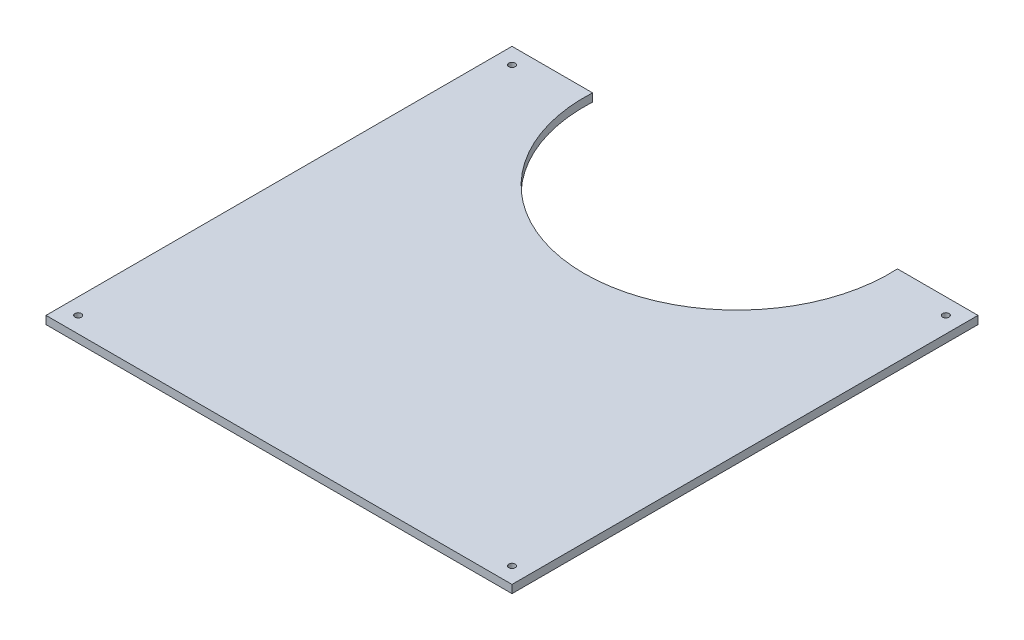
ISO-10303-21;
HEADER;
FILE_DESCRIPTION(('STEP AP214'),'2;1');
FILE_NAME('part.step','',(''),(''),'','','');
FILE_SCHEMA(('AUTOMOTIVE_DESIGN { 1 0 10303 214 1 1 1 1 }'));
ENDSEC;
DATA;
#1=APPLICATION_CONTEXT('core data for automotive mechanical design processes');
#2=APPLICATION_PROTOCOL_DEFINITION('international standard','automotive_design',2000,#1);
#3=PRODUCT_CONTEXT('',#1,'mechanical');
#4=PRODUCT('Part','Part','',(#3));
#5=PRODUCT_RELATED_PRODUCT_CATEGORY('part','',(#4));
#6=PRODUCT_DEFINITION_FORMATION('','',#4);
#7=PRODUCT_DEFINITION_CONTEXT('part definition',#1,'design');
#8=PRODUCT_DEFINITION('design','',#6,#7);
#9=PRODUCT_DEFINITION_SHAPE('','',#8);
#10=(LENGTH_UNIT() NAMED_UNIT(*) SI_UNIT(.MILLI.,.METRE.));
#11=(NAMED_UNIT(*) PLANE_ANGLE_UNIT() SI_UNIT($,.RADIAN.));
#12=(NAMED_UNIT(*) SI_UNIT($,.STERADIAN.) SOLID_ANGLE_UNIT());
#13=UNCERTAINTY_MEASURE_WITH_UNIT(LENGTH_MEASURE(1.E-05),#10,'distance_accuracy_value','');
#14=(GEOMETRIC_REPRESENTATION_CONTEXT(3) GLOBAL_UNCERTAINTY_ASSIGNED_CONTEXT((#13)) GLOBAL_UNIT_ASSIGNED_CONTEXT((#10,
#11,#12)) REPRESENTATION_CONTEXT('',''));
#15=CARTESIAN_POINT('',(0.,0.,0.));
#16=DIRECTION('',(0.,0.,1.));
#17=DIRECTION('',(1.,0.,0.));
#18=AXIS2_PLACEMENT_3D('',#15,#16,#17);
#19=CARTESIAN_POINT('',(0.,5.,0.));
#20=DIRECTION('',(1.,0.,0.));
#21=DIRECTION('',(0.,0.,-1.));
#22=AXIS2_PLACEMENT_3D('',#19,#20,#21);
#23=PLANE('',#22);
#24=DIRECTION('',(0.,0.,1.));
#25=VECTOR('',#24,1.);
#26=CARTESIAN_POINT('',(0.,0.,0.));
#27=LINE('',#26,#25);
#28=CARTESIAN_POINT('',(0.,0.,-290.));
#29=VERTEX_POINT('',#28);
#30=CARTESIAN_POINT('',(0.,0.,0.));
#31=VERTEX_POINT('',#30);
#32=EDGE_CURVE('E119',#29,#31,#27,.T.);
#33=ORIENTED_EDGE('',*,*,#32,.T.);
#34=DIRECTION('',(0.,-1.,0.));
#35=VECTOR('',#34,1.);
#36=CARTESIAN_POINT('',(0.,5.,0.));
#37=LINE('',#36,#35);
#38=CARTESIAN_POINT('',(0.,5.,0.));
#39=VERTEX_POINT('',#38);
#40=EDGE_CURVE('E11',#39,#31,#37,.T.);
#41=ORIENTED_EDGE('',*,*,#40,.F.);
#42=DIRECTION('',(0.,0.,1.));
#43=VECTOR('',#42,1.);
#44=CARTESIAN_POINT('',(0.,5.,0.));
#45=LINE('',#44,#43);
#46=CARTESIAN_POINT('',(0.,5.,-290.));
#47=VERTEX_POINT('',#46);
#48=EDGE_CURVE('E130',#47,#39,#45,.T.);
#49=ORIENTED_EDGE('',*,*,#48,.F.);
#50=DIRECTION('',(0.,-1.,0.));
#51=VECTOR('',#50,1.);
#52=CARTESIAN_POINT('',(0.,5.,-290.));
#53=LINE('',#52,#51);
#54=EDGE_CURVE('E115',#47,#29,#53,.T.);
#55=ORIENTED_EDGE('',*,*,#54,.T.);
#56=EDGE_LOOP('',(#33,#41,#49,#55));
#57=FACE_BOUND('',#56,.T.);
#58=ADVANCED_FACE('F33',(#57),#23,.F.);
#59=CARTESIAN_POINT('',(0.,5.,0.));
#60=DIRECTION('',(0.,0.,-1.));
#61=DIRECTION('',(-1.,0.,0.));
#62=AXIS2_PLACEMENT_3D('',#59,#60,#61);
#63=PLANE('',#62);
#64=DIRECTION('',(1.,0.,0.));
#65=VECTOR('',#64,1.);
#66=CARTESIAN_POINT('',(0.,0.,0.));
#67=LINE('',#66,#65);
#68=CARTESIAN_POINT('',(290.,0.,0.));
#69=VERTEX_POINT('',#68);
#70=EDGE_CURVE('E122',#31,#69,#67,.T.);
#71=ORIENTED_EDGE('',*,*,#70,.T.);
#72=DIRECTION('',(0.,-1.,0.));
#73=VECTOR('',#72,1.);
#74=CARTESIAN_POINT('',(290.,5.,0.));
#75=LINE('',#74,#73);
#76=CARTESIAN_POINT('',(290.,5.,0.));
#77=VERTEX_POINT('',#76);
#78=EDGE_CURVE('E42',#77,#69,#75,.T.);
#79=ORIENTED_EDGE('',*,*,#78,.F.);
#80=DIRECTION('',(1.,0.,0.));
#81=VECTOR('',#80,1.);
#82=CARTESIAN_POINT('',(0.,5.,0.));
#83=LINE('',#82,#81);
#84=EDGE_CURVE('E88',#39,#77,#83,.T.);
#85=ORIENTED_EDGE('',*,*,#84,.F.);
#86=ORIENTED_EDGE('',*,*,#40,.T.);
#87=EDGE_LOOP('',(#71,#79,#85,#86));
#88=FACE_BOUND('',#87,.T.);
#89=ADVANCED_FACE('F162',(#88),#63,.F.);
#90=CARTESIAN_POINT('',(290.,5.,0.));
#91=DIRECTION('',(-1.,0.,0.));
#92=DIRECTION('',(0.,0.,1.));
#93=AXIS2_PLACEMENT_3D('',#90,#91,#92);
#94=PLANE('',#93);
#95=DIRECTION('',(0.,0.,-1.));
#96=VECTOR('',#95,1.);
#97=CARTESIAN_POINT('',(290.,0.,0.));
#98=LINE('',#97,#96);
#99=CARTESIAN_POINT('',(290.,0.,-290.));
#100=VERTEX_POINT('',#99);
#101=EDGE_CURVE('E125',#69,#100,#98,.T.);
#102=ORIENTED_EDGE('',*,*,#101,.T.);
#103=DIRECTION('',(0.,-1.,0.));
#104=VECTOR('',#103,1.);
#105=CARTESIAN_POINT('',(290.,5.,-290.));
#106=LINE('',#105,#104);
#107=CARTESIAN_POINT('',(290.,5.,-290.));
#108=VERTEX_POINT('',#107);
#109=EDGE_CURVE('E110',#108,#100,#106,.T.);
#110=ORIENTED_EDGE('',*,*,#109,.F.);
#111=DIRECTION('',(0.,0.,-1.));
#112=VECTOR('',#111,1.);
#113=CARTESIAN_POINT('',(290.,5.,0.));
#114=LINE('',#113,#112);
#115=EDGE_CURVE('E101',#77,#108,#114,.T.);
#116=ORIENTED_EDGE('',*,*,#115,.F.);
#117=ORIENTED_EDGE('',*,*,#78,.T.);
#118=EDGE_LOOP('',(#102,#110,#116,#117));
#119=FACE_BOUND('',#118,.T.);
#120=ADVANCED_FACE('F165',(#119),#94,.F.);
#121=CARTESIAN_POINT('',(239.868329805051,5.,-290.));
#122=DIRECTION('',(0.,0.,1.));
#123=DIRECTION('',(1.,0.,0.));
#124=AXIS2_PLACEMENT_3D('',#121,#122,#123);
#125=PLANE('',#124);
#126=DIRECTION('',(-1.,0.,0.));
#127=VECTOR('',#126,1.);
#128=CARTESIAN_POINT('',(239.868329805051,0.,-290.));
#129=LINE('',#128,#127);
#130=CARTESIAN_POINT('',(239.868329805051,0.,-290.));
#131=VERTEX_POINT('',#130);
#132=EDGE_CURVE('E109',#100,#131,#129,.T.);
#133=ORIENTED_EDGE('',*,*,#132,.T.);
#134=DIRECTION('',(0.,-1.,0.));
#135=VECTOR('',#134,1.);
#136=CARTESIAN_POINT('',(239.868329805051,5.,-290.));
#137=LINE('',#136,#135);
#138=CARTESIAN_POINT('',(239.868329805051,5.,-290.));
#139=VERTEX_POINT('',#138);
#140=EDGE_CURVE('E106',#139,#131,#137,.T.);
#141=ORIENTED_EDGE('',*,*,#140,.F.);
#142=DIRECTION('',(-1.,0.,0.));
#143=VECTOR('',#142,1.);
#144=CARTESIAN_POINT('',(239.868329805051,5.,-290.));
#145=LINE('',#144,#143);
#146=EDGE_CURVE('E95',#108,#139,#145,.T.);
#147=ORIENTED_EDGE('',*,*,#146,.F.);
#148=ORIENTED_EDGE('',*,*,#109,.T.);
#149=EDGE_LOOP('',(#133,#141,#147,#148));
#150=FACE_BOUND('',#149,.T.);
#151=ADVANCED_FACE('F107',(#150),#125,.F.);
#152=CARTESIAN_POINT('',(145.,5.,-285.));
#153=DIRECTION('',(0.,-1.,0.));
#154=DIRECTION('',(0.,0.,-1.));
#155=AXIS2_PLACEMENT_3D('',#152,#153,#154);
#156=CYLINDRICAL_SURFACE('',#155,95.);
#157=CARTESIAN_POINT('',(145.,0.,-285.));
#158=DIRECTION('',(0.,-1.,0.));
#159=DIRECTION('',(0.,0.,1.));
#160=AXIS2_PLACEMENT_3D('',#157,#158,#159);
#161=CIRCLE('',#160,95.);
#162=CARTESIAN_POINT('',(50.1316701949486,0.,-290.));
#163=VERTEX_POINT('',#162);
#164=EDGE_CURVE('E74',#131,#163,#161,.T.);
#165=ORIENTED_EDGE('',*,*,#164,.T.);
#166=DIRECTION('',(0.,-1.,0.));
#167=VECTOR('',#166,1.);
#168=CARTESIAN_POINT('',(50.1316701949486,5.,-290.));
#169=LINE('',#168,#167);
#170=CARTESIAN_POINT('',(50.1316701949486,5.,-290.));
#171=VERTEX_POINT('',#170);
#172=EDGE_CURVE('E111',#171,#163,#169,.T.);
#173=ORIENTED_EDGE('',*,*,#172,.F.);
#174=CARTESIAN_POINT('',(145.,5.,-285.));
#175=DIRECTION('',(0.,-1.,0.));
#176=DIRECTION('',(0.,0.,1.));
#177=AXIS2_PLACEMENT_3D('',#174,#175,#176);
#178=CIRCLE('',#177,95.);
#179=EDGE_CURVE('E99',#139,#171,#178,.T.);
#180=ORIENTED_EDGE('',*,*,#179,.F.);
#181=ORIENTED_EDGE('',*,*,#140,.T.);
#182=EDGE_LOOP('',(#165,#173,#180,#181));
#183=FACE_BOUND('',#182,.T.);
#184=ADVANCED_FACE('F113',(#183),#156,.F.);
#185=CARTESIAN_POINT('',(0.,5.,-290.));
#186=DIRECTION('',(0.,0.,1.));
#187=DIRECTION('',(1.,0.,0.));
#188=AXIS2_PLACEMENT_3D('',#185,#186,#187);
#189=PLANE('',#188);
#190=DIRECTION('',(-1.,0.,0.));
#191=VECTOR('',#190,1.);
#192=CARTESIAN_POINT('',(0.,0.,-290.));
#193=LINE('',#192,#191);
#194=EDGE_CURVE('E80',#163,#29,#193,.T.);
#195=ORIENTED_EDGE('',*,*,#194,.T.);
#196=ORIENTED_EDGE('',*,*,#54,.F.);
#197=DIRECTION('',(-1.,0.,0.));
#198=VECTOR('',#197,1.);
#199=CARTESIAN_POINT('',(0.,5.,-290.));
#200=LINE('',#199,#198);
#201=EDGE_CURVE('E51',#171,#47,#200,.T.);
#202=ORIENTED_EDGE('',*,*,#201,.F.);
#203=ORIENTED_EDGE('',*,*,#172,.T.);
#204=EDGE_LOOP('',(#195,#196,#202,#203));
#205=FACE_BOUND('',#204,.T.);
#206=ADVANCED_FACE('F170',(#205),#189,.F.);
#207=CARTESIAN_POINT('',(145.,5.,-285.));
#208=DIRECTION('',(0.,1.,0.));
#209=DIRECTION('',(0.,0.,1.));
#210=AXIS2_PLACEMENT_3D('',#207,#208,#209);
#211=PLANE('',#210);
#212=CARTESIAN_POINT('',(10.,5.,-10.0000000000001));
#213=DIRECTION('',(0.,1.,0.));
#214=DIRECTION('',(0.,0.,-1.));
#215=AXIS2_PLACEMENT_3D('',#212,#213,#214);
#216=CIRCLE('',#215,2.);
#217=CARTESIAN_POINT('',(10.,5.,-12.0000000000001));
#218=VERTEX_POINT('',#217);
#219=EDGE_CURVE('E154',#218,#218,#216,.T.);
#220=ORIENTED_EDGE('',*,*,#219,.F.);
#221=EDGE_LOOP('',(#220));
#222=FACE_BOUND('',#221,.T.);
#223=CARTESIAN_POINT('',(280.,5.,-10.0000000000001));
#224=DIRECTION('',(0.,1.,0.));
#225=DIRECTION('',(0.,0.,1.));
#226=AXIS2_PLACEMENT_3D('',#223,#224,#225);
#227=CIRCLE('',#226,2.);
#228=CARTESIAN_POINT('',(280.,5.,-8.00000000000007));
#229=VERTEX_POINT('',#228);
#230=EDGE_CURVE('E144',#229,#229,#227,.T.);
#231=ORIENTED_EDGE('',*,*,#230,.F.);
#232=EDGE_LOOP('',(#231));
#233=FACE_BOUND('',#232,.T.);
#234=CARTESIAN_POINT('',(280.,5.,-280.));
#235=DIRECTION('',(0.,1.,0.));
#236=DIRECTION('',(0.,0.,-1.));
#237=AXIS2_PLACEMENT_3D('',#234,#235,#236);
#238=CIRCLE('',#237,2.);
#239=CARTESIAN_POINT('',(280.,5.,-282.));
#240=VERTEX_POINT('',#239);
#241=EDGE_CURVE('E141',#240,#240,#238,.T.);
#242=ORIENTED_EDGE('',*,*,#241,.F.);
#243=EDGE_LOOP('',(#242));
#244=FACE_BOUND('',#243,.T.);
#245=CARTESIAN_POINT('',(10.,5.,-280.));
#246=DIRECTION('',(0.,1.,0.));
#247=DIRECTION('',(0.,0.,1.));
#248=AXIS2_PLACEMENT_3D('',#245,#246,#247);
#249=CIRCLE('',#248,2.);
#250=CARTESIAN_POINT('',(10.,5.,-278.));
#251=VERTEX_POINT('',#250);
#252=EDGE_CURVE('E138',#251,#251,#249,.T.);
#253=ORIENTED_EDGE('',*,*,#252,.F.);
#254=EDGE_LOOP('',(#253));
#255=FACE_BOUND('',#254,.T.);
#256=ORIENTED_EDGE('',*,*,#48,.T.);
#257=ORIENTED_EDGE('',*,*,#84,.T.);
#258=ORIENTED_EDGE('',*,*,#115,.T.);
#259=ORIENTED_EDGE('',*,*,#146,.T.);
#260=ORIENTED_EDGE('',*,*,#179,.T.);
#261=ORIENTED_EDGE('',*,*,#201,.T.);
#262=EDGE_LOOP('',(#256,#257,#258,#259,#260,#261));
#263=FACE_BOUND('',#262,.T.);
#264=ADVANCED_FACE('F97',(#222,#233,#244,#255,#263),#211,.T.);
#265=CARTESIAN_POINT('',(145.,0.,-285.));
#266=DIRECTION('',(0.,1.,0.));
#267=DIRECTION('',(0.,0.,1.));
#268=AXIS2_PLACEMENT_3D('',#265,#266,#267);
#269=PLANE('',#268);
#270=CARTESIAN_POINT('',(10.,0.,-10.0000000000001));
#271=DIRECTION('',(0.,1.,0.));
#272=DIRECTION('',(0.,0.,1.));
#273=AXIS2_PLACEMENT_3D('',#270,#271,#272);
#274=CIRCLE('',#273,2.);
#275=CARTESIAN_POINT('',(10.,0.,-8.00000000000006));
#276=VERTEX_POINT('',#275);
#277=EDGE_CURVE('E36',#276,#276,#274,.T.);
#278=ORIENTED_EDGE('',*,*,#277,.T.);
#279=EDGE_LOOP('',(#278));
#280=FACE_BOUND('',#279,.T.);
#281=CARTESIAN_POINT('',(280.,0.,-10.0000000000001));
#282=DIRECTION('',(0.,1.,0.));
#283=DIRECTION('',(0.,0.,1.));
#284=AXIS2_PLACEMENT_3D('',#281,#282,#283);
#285=CIRCLE('',#284,2.);
#286=CARTESIAN_POINT('',(280.,0.,-8.00000000000007));
#287=VERTEX_POINT('',#286);
#288=EDGE_CURVE('E142',#287,#287,#285,.T.);
#289=ORIENTED_EDGE('',*,*,#288,.T.);
#290=EDGE_LOOP('',(#289));
#291=FACE_BOUND('',#290,.T.);
#292=CARTESIAN_POINT('',(280.,0.,-280.));
#293=DIRECTION('',(0.,1.,0.));
#294=DIRECTION('',(0.,0.,1.));
#295=AXIS2_PLACEMENT_3D('',#292,#293,#294);
#296=CIRCLE('',#295,2.);
#297=CARTESIAN_POINT('',(280.,0.,-278.));
#298=VERTEX_POINT('',#297);
#299=EDGE_CURVE('E139',#298,#298,#296,.T.);
#300=ORIENTED_EDGE('',*,*,#299,.T.);
#301=EDGE_LOOP('',(#300));
#302=FACE_BOUND('',#301,.T.);
#303=CARTESIAN_POINT('',(10.,0.,-280.));
#304=DIRECTION('',(0.,1.,0.));
#305=DIRECTION('',(0.,0.,1.));
#306=AXIS2_PLACEMENT_3D('',#303,#304,#305);
#307=CIRCLE('',#306,2.);
#308=CARTESIAN_POINT('',(10.,0.,-278.));
#309=VERTEX_POINT('',#308);
#310=EDGE_CURVE('E123',#309,#309,#307,.T.);
#311=ORIENTED_EDGE('',*,*,#310,.T.);
#312=EDGE_LOOP('',(#311));
#313=FACE_BOUND('',#312,.T.);
#314=ORIENTED_EDGE('',*,*,#32,.F.);
#315=ORIENTED_EDGE('',*,*,#194,.F.);
#316=ORIENTED_EDGE('',*,*,#164,.F.);
#317=ORIENTED_EDGE('',*,*,#132,.F.);
#318=ORIENTED_EDGE('',*,*,#101,.F.);
#319=ORIENTED_EDGE('',*,*,#70,.F.);
#320=EDGE_LOOP('',(#314,#315,#316,#317,#318,#319));
#321=FACE_BOUND('',#320,.T.);
#322=ADVANCED_FACE('F168',(#280,#291,#302,#313,#321),#269,.F.);
#323=CARTESIAN_POINT('',(10.,-5.,-280.));
#324=DIRECTION('',(0.,1.,0.));
#325=DIRECTION('',(0.,0.,1.));
#326=AXIS2_PLACEMENT_3D('',#323,#324,#325);
#327=CYLINDRICAL_SURFACE('',#326,2.);
#328=ORIENTED_EDGE('',*,*,#252,.T.);
#329=EDGE_LOOP('',(#328));
#330=FACE_BOUND('',#329,.T.);
#331=ORIENTED_EDGE('',*,*,#310,.F.);
#332=EDGE_LOOP('',(#331));
#333=FACE_BOUND('',#332,.T.);
#334=ADVANCED_FACE('F218',(#330,#333),#327,.F.);
#335=CARTESIAN_POINT('',(280.,-5.,-280.));
#336=DIRECTION('',(0.,1.,0.));
#337=DIRECTION('',(0.,0.,1.));
#338=AXIS2_PLACEMENT_3D('',#335,#336,#337);
#339=CYLINDRICAL_SURFACE('',#338,2.);
#340=ORIENTED_EDGE('',*,*,#241,.T.);
#341=EDGE_LOOP('',(#340));
#342=FACE_BOUND('',#341,.T.);
#343=ORIENTED_EDGE('',*,*,#299,.F.);
#344=EDGE_LOOP('',(#343));
#345=FACE_BOUND('',#344,.T.);
#346=ADVANCED_FACE('F227',(#342,#345),#339,.F.);
#347=CARTESIAN_POINT('',(280.,-5.,-10.0000000000001));
#348=DIRECTION('',(0.,1.,0.));
#349=DIRECTION('',(0.,0.,1.));
#350=AXIS2_PLACEMENT_3D('',#347,#348,#349);
#351=CYLINDRICAL_SURFACE('',#350,2.);
#352=ORIENTED_EDGE('',*,*,#230,.T.);
#353=EDGE_LOOP('',(#352));
#354=FACE_BOUND('',#353,.T.);
#355=ORIENTED_EDGE('',*,*,#288,.F.);
#356=EDGE_LOOP('',(#355));
#357=FACE_BOUND('',#356,.T.);
#358=ADVANCED_FACE('F237',(#354,#357),#351,.F.);
#359=CARTESIAN_POINT('',(10.,-5.,-10.0000000000001));
#360=DIRECTION('',(0.,1.,0.));
#361=DIRECTION('',(0.,0.,1.));
#362=AXIS2_PLACEMENT_3D('',#359,#360,#361);
#363=CYLINDRICAL_SURFACE('',#362,2.);
#364=ORIENTED_EDGE('',*,*,#219,.T.);
#365=EDGE_LOOP('',(#364));
#366=FACE_BOUND('',#365,.T.);
#367=ORIENTED_EDGE('',*,*,#277,.F.);
#368=EDGE_LOOP('',(#367));
#369=FACE_BOUND('',#368,.T.);
#370=ADVANCED_FACE('F247',(#366,#369),#363,.F.);
#371=CLOSED_SHELL('',(#58,#89,#120,#151,#184,#206,#264,#322,#334,#346,#358,#370));
#372=MANIFOLD_SOLID_BREP('B2',#371);
#373=ADVANCED_BREP_SHAPE_REPRESENTATION('',(#18,#372),#14);
#374=SHAPE_DEFINITION_REPRESENTATION(#9,#373);
ENDSEC;
END-ISO-10303-21;
